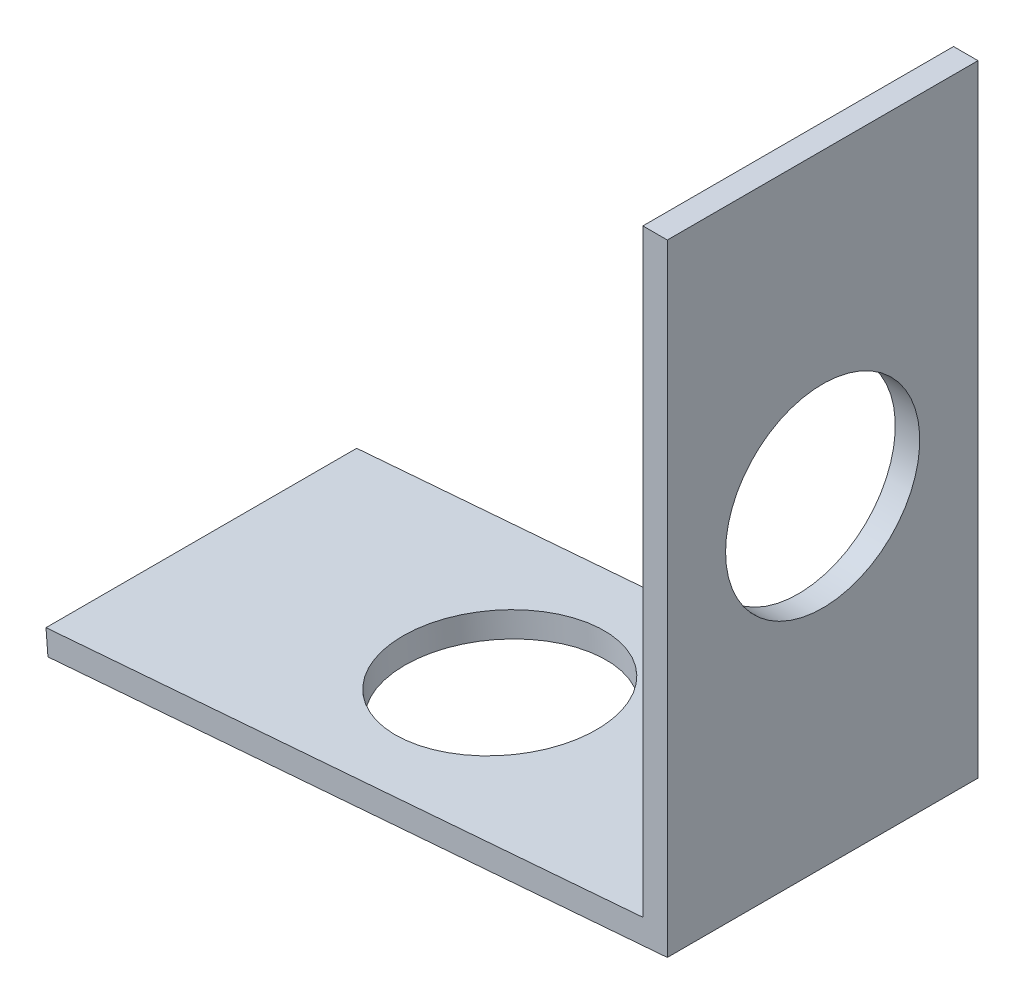
ISO-10303-21;
HEADER;
FILE_DESCRIPTION(('STEP AP214'),'2;1');
FILE_NAME('part.step','',(''),(''),'','','');
FILE_SCHEMA(('AUTOMOTIVE_DESIGN { 1 0 10303 214 1 1 1 1 }'));
ENDSEC;
DATA;
#1=APPLICATION_CONTEXT('core data for automotive mechanical design processes');
#2=APPLICATION_PROTOCOL_DEFINITION('international standard','automotive_design',2000,#1);
#3=PRODUCT_CONTEXT('',#1,'mechanical');
#4=PRODUCT('Part','Part','',(#3));
#5=PRODUCT_RELATED_PRODUCT_CATEGORY('part','',(#4));
#6=PRODUCT_DEFINITION_FORMATION('','',#4);
#7=PRODUCT_DEFINITION_CONTEXT('part definition',#1,'design');
#8=PRODUCT_DEFINITION('design','',#6,#7);
#9=PRODUCT_DEFINITION_SHAPE('','',#8);
#10=(LENGTH_UNIT() NAMED_UNIT(*) SI_UNIT(.MILLI.,.METRE.));
#11=(NAMED_UNIT(*) PLANE_ANGLE_UNIT() SI_UNIT($,.RADIAN.));
#12=(NAMED_UNIT(*) SI_UNIT($,.STERADIAN.) SOLID_ANGLE_UNIT());
#13=UNCERTAINTY_MEASURE_WITH_UNIT(LENGTH_MEASURE(1.E-05),#10,'distance_accuracy_value','');
#14=(GEOMETRIC_REPRESENTATION_CONTEXT(3) GLOBAL_UNCERTAINTY_ASSIGNED_CONTEXT((#13)) GLOBAL_UNIT_ASSIGNED_CONTEXT((#10,
#11,#12)) REPRESENTATION_CONTEXT('',''));
#15=CARTESIAN_POINT('',(0.,0.,0.));
#16=DIRECTION('',(0.,0.,1.));
#17=DIRECTION('',(1.,0.,0.));
#18=AXIS2_PLACEMENT_3D('',#15,#16,#17);
#19=CARTESIAN_POINT('',(0.,0.,6.35));
#20=DIRECTION('',(-0.079503021907664,0.996834624954184,0.));
#21=DIRECTION('',(-0.996834624954185,-0.079503021907664,0.));
#22=AXIS2_PLACEMENT_3D('',#19,#20,#21);
#23=PLANE('',#22);
#24=CARTESIAN_POINT('',(-13.1200482259643,-1.04639571642728,0.));
#25=DIRECTION('',(-0.079503021907664,0.996834624954184,0.));
#26=DIRECTION('',(-0.996834624954185,-0.079503021907664,0.));
#27=AXIS2_PLACEMENT_3D('',#24,#25,#26);
#28=CIRCLE('',#27,3.96874999999999);
#29=CARTESIAN_POINT('',(-17.0762356437512,-1.36192333462332,0.));
#30=VERTEX_POINT('',#29);
#31=EDGE_CURVE('E186',#30,#30,#28,.T.);
#32=ORIENTED_EDGE('',*,*,#31,.T.);
#33=EDGE_LOOP('',(#32));
#34=FACE_BOUND('',#33,.T.);
#35=DIRECTION('',(0.996834624954184,0.079503021907664,0.));
#36=VECTOR('',#35,1.);
#37=CARTESIAN_POINT('',(0.,0.,-6.35));
#38=LINE('',#37,#36);
#39=CARTESIAN_POINT('',(-25.3195994738363,-2.01937675645467,-6.35));
#40=VERTEX_POINT('',#39);
#41=CARTESIAN_POINT('',(0.,0.,-6.35));
#42=VERTEX_POINT('',#41);
#43=EDGE_CURVE('E132',#40,#42,#38,.T.);
#44=ORIENTED_EDGE('',*,*,#43,.T.);
#45=DIRECTION('',(0.,0.,-1.));
#46=VECTOR('',#45,1.);
#47=CARTESIAN_POINT('',(0.,0.,6.35));
#48=LINE('',#47,#46);
#49=CARTESIAN_POINT('',(0.,0.,6.35));
#50=VERTEX_POINT('',#49);
#51=EDGE_CURVE('E11',#50,#42,#48,.T.);
#52=ORIENTED_EDGE('',*,*,#51,.F.);
#53=DIRECTION('',(0.996834624954184,0.079503021907664,0.));
#54=VECTOR('',#53,1.);
#55=CARTESIAN_POINT('',(0.,0.,6.35));
#56=LINE('',#55,#54);
#57=CARTESIAN_POINT('',(-25.3195994738363,-2.01937675645467,6.35));
#58=VERTEX_POINT('',#57);
#59=EDGE_CURVE('E149',#58,#50,#56,.T.);
#60=ORIENTED_EDGE('',*,*,#59,.F.);
#61=DIRECTION('',(0.,0.,-1.));
#62=VECTOR('',#61,1.);
#63=CARTESIAN_POINT('',(-25.3195994738363,-2.01937675645467,6.35));
#64=LINE('',#63,#62);
#65=EDGE_CURVE('E128',#58,#40,#64,.T.);
#66=ORIENTED_EDGE('',*,*,#65,.T.);
#67=EDGE_LOOP('',(#44,#52,#60,#66));
#68=FACE_BOUND('',#67,.T.);
#69=ADVANCED_FACE('F43',(#34,#68),#23,.F.);
#70=CARTESIAN_POINT('',(0.,0.,6.35));
#71=DIRECTION('',(-1.,0.,0.));
#72=DIRECTION('',(0.,-1.,0.));
#73=AXIS2_PLACEMENT_3D('',#70,#71,#72);
#74=PLANE('',#73);
#75=CARTESIAN_POINT('',(0.,13.1617099742771,0.));
#76=DIRECTION('',(-1.,0.,0.));
#77=DIRECTION('',(0.,0.,1.));
#78=AXIS2_PLACEMENT_3D('',#75,#76,#77);
#79=CIRCLE('',#78,3.96875);
#80=CARTESIAN_POINT('',(0.,13.1617099742771,3.96875));
#81=VERTEX_POINT('',#80);
#82=EDGE_CURVE('E137',#81,#81,#79,.T.);
#83=ORIENTED_EDGE('',*,*,#82,.T.);
#84=EDGE_LOOP('',(#83));
#85=FACE_BOUND('',#84,.T.);
#86=DIRECTION('',(0.,1.,0.));
#87=VECTOR('',#86,1.);
#88=CARTESIAN_POINT('',(0.,0.,-6.35));
#89=LINE('',#88,#87);
#90=CARTESIAN_POINT('',(0.,25.4,-6.35));
#91=VERTEX_POINT('',#90);
#92=EDGE_CURVE('E136',#42,#91,#89,.T.);
#93=ORIENTED_EDGE('',*,*,#92,.T.);
#94=DIRECTION('',(0.,0.,-1.));
#95=VECTOR('',#94,1.);
#96=CARTESIAN_POINT('',(0.,25.4,6.35));
#97=LINE('',#96,#95);
#98=CARTESIAN_POINT('',(0.,25.4,6.35));
#99=VERTEX_POINT('',#98);
#100=EDGE_CURVE('E52',#99,#91,#97,.T.);
#101=ORIENTED_EDGE('',*,*,#100,.F.);
#102=DIRECTION('',(0.,1.,0.));
#103=VECTOR('',#102,1.);
#104=CARTESIAN_POINT('',(0.,0.,6.35));
#105=LINE('',#104,#103);
#106=EDGE_CURVE('E97',#50,#99,#105,.T.);
#107=ORIENTED_EDGE('',*,*,#106,.F.);
#108=ORIENTED_EDGE('',*,*,#51,.T.);
#109=EDGE_LOOP('',(#93,#101,#107,#108));
#110=FACE_BOUND('',#109,.T.);
#111=ADVANCED_FACE('F178',(#85,#110),#74,.F.);
#112=CARTESIAN_POINT('',(-1.,25.4,6.35));
#113=DIRECTION('',(0.,-1.,0.));
#114=DIRECTION('',(0.,0.,-1.));
#115=AXIS2_PLACEMENT_3D('',#112,#113,#114);
#116=PLANE('',#115);
#117=DIRECTION('',(-1.,0.,0.));
#118=VECTOR('',#117,1.);
#119=CARTESIAN_POINT('',(-1.,25.4,-6.35));
#120=LINE('',#119,#118);
#121=CARTESIAN_POINT('',(-1.,25.4,-6.35));
#122=VERTEX_POINT('',#121);
#123=EDGE_CURVE('E140',#91,#122,#120,.T.);
#124=ORIENTED_EDGE('',*,*,#123,.T.);
#125=DIRECTION('',(0.,0.,-1.));
#126=VECTOR('',#125,1.);
#127=CARTESIAN_POINT('',(-1.,25.4,6.35));
#128=LINE('',#127,#126);
#129=CARTESIAN_POINT('',(-1.,25.4,6.35));
#130=VERTEX_POINT('',#129);
#131=EDGE_CURVE('E121',#130,#122,#128,.T.);
#132=ORIENTED_EDGE('',*,*,#131,.F.);
#133=DIRECTION('',(-1.,0.,0.));
#134=VECTOR('',#133,1.);
#135=CARTESIAN_POINT('',(-1.,25.4,6.35));
#136=LINE('',#135,#134);
#137=EDGE_CURVE('E110',#99,#130,#136,.T.);
#138=ORIENTED_EDGE('',*,*,#137,.F.);
#139=ORIENTED_EDGE('',*,*,#100,.T.);
#140=EDGE_LOOP('',(#124,#132,#138,#139));
#141=FACE_BOUND('',#140,.T.);
#142=ADVANCED_FACE('F159',(#141),#116,.F.);
#143=CARTESIAN_POINT('',(-1.,0.923419948554298,6.35));
#144=DIRECTION('',(1.,0.,0.));
#145=DIRECTION('',(0.,1.,0.));
#146=AXIS2_PLACEMENT_3D('',#143,#144,#145);
#147=PLANE('',#146);
#148=CARTESIAN_POINT('',(-1.,13.1617099742771,0.));
#149=DIRECTION('',(-1.,0.,0.));
#150=DIRECTION('',(0.,0.,1.));
#151=AXIS2_PLACEMENT_3D('',#148,#149,#150);
#152=CIRCLE('',#151,3.96874999999999);
#153=CARTESIAN_POINT('',(-1.,13.1617099742771,3.96874999999999));
#154=VERTEX_POINT('',#153);
#155=EDGE_CURVE('E189',#154,#154,#152,.T.);
#156=ORIENTED_EDGE('',*,*,#155,.F.);
#157=EDGE_LOOP('',(#156));
#158=FACE_BOUND('',#157,.T.);
#159=DIRECTION('',(0.,-1.,0.));
#160=VECTOR('',#159,1.);
#161=CARTESIAN_POINT('',(-1.,0.923419948554298,-6.35));
#162=LINE('',#161,#160);
#163=CARTESIAN_POINT('',(-1.,0.923419948554298,-6.35));
#164=VERTEX_POINT('',#163);
#165=EDGE_CURVE('E119',#122,#164,#162,.T.);
#166=ORIENTED_EDGE('',*,*,#165,.T.);
#167=DIRECTION('',(0.,0.,-1.));
#168=VECTOR('',#167,1.);
#169=CARTESIAN_POINT('',(-1.,0.923419948554298,6.35));
#170=LINE('',#169,#168);
#171=CARTESIAN_POINT('',(-1.,0.923419948554298,6.35));
#172=VERTEX_POINT('',#171);
#173=EDGE_CURVE('E116',#172,#164,#170,.T.);
#174=ORIENTED_EDGE('',*,*,#173,.F.);
#175=DIRECTION('',(0.,-1.,0.));
#176=VECTOR('',#175,1.);
#177=CARTESIAN_POINT('',(-1.,0.923419948554298,6.35));
#178=LINE('',#177,#176);
#179=EDGE_CURVE('E104',#130,#172,#178,.T.);
#180=ORIENTED_EDGE('',*,*,#179,.F.);
#181=ORIENTED_EDGE('',*,*,#131,.T.);
#182=EDGE_LOOP('',(#166,#174,#180,#181));
#183=FACE_BOUND('',#182,.T.);
#184=ADVANCED_FACE('F117',(#158,#183),#147,.F.);
#185=CARTESIAN_POINT('',(-1.,0.923419948554298,6.35));
#186=DIRECTION('',(0.079503021907664,-0.996834624954184,0.));
#187=DIRECTION('',(0.996834624954184,0.079503021907664,0.));
#188=AXIS2_PLACEMENT_3D('',#185,#186,#187);
#189=PLANE('',#188);
#190=CARTESIAN_POINT('',(-13.199551247872,-0.0495610914730905,0.));
#191=DIRECTION('',(-0.079503021907664,0.996834624954185,0.));
#192=DIRECTION('',(-0.996834624954185,-0.079503021907664,0.));
#193=AXIS2_PLACEMENT_3D('',#190,#191,#192);
#194=CIRCLE('',#193,3.96874999999999);
#195=CARTESIAN_POINT('',(-17.1557386656589,-0.365088709669131,0.));
#196=VERTEX_POINT('',#195);
#197=EDGE_CURVE('E190',#196,#196,#194,.T.);
#198=ORIENTED_EDGE('',*,*,#197,.F.);
#199=EDGE_LOOP('',(#198));
#200=FACE_BOUND('',#199,.T.);
#201=DIRECTION('',(-0.996834624954185,-0.0795030219076641,0.));
#202=VECTOR('',#201,1.);
#203=CARTESIAN_POINT('',(-1.,0.923419948554298,-6.35));
#204=LINE('',#203,#202);
#205=CARTESIAN_POINT('',(-25.3991024957439,-1.02254213150048,-6.35));
#206=VERTEX_POINT('',#205);
#207=EDGE_CURVE('E83',#164,#206,#204,.T.);
#208=ORIENTED_EDGE('',*,*,#207,.T.);
#209=DIRECTION('',(0.,0.,-1.));
#210=VECTOR('',#209,1.);
#211=CARTESIAN_POINT('',(-25.3991024957439,-1.02254213150048,6.35));
#212=LINE('',#211,#210);
#213=CARTESIAN_POINT('',(-25.3991024957439,-1.02254213150048,6.35));
#214=VERTEX_POINT('',#213);
#215=EDGE_CURVE('E122',#214,#206,#212,.T.);
#216=ORIENTED_EDGE('',*,*,#215,.F.);
#217=DIRECTION('',(-0.996834624954185,-0.0795030219076641,0.));
#218=VECTOR('',#217,1.);
#219=CARTESIAN_POINT('',(-1.,0.923419948554298,6.35));
#220=LINE('',#219,#218);
#221=EDGE_CURVE('E108',#172,#214,#220,.T.);
#222=ORIENTED_EDGE('',*,*,#221,.F.);
#223=ORIENTED_EDGE('',*,*,#173,.T.);
#224=EDGE_LOOP('',(#208,#216,#222,#223));
#225=FACE_BOUND('',#224,.T.);
#226=ADVANCED_FACE('F124',(#200,#225),#189,.F.);
#227=CARTESIAN_POINT('',(-25.3991024957439,-1.02254213150048,6.35));
#228=DIRECTION('',(0.996834624954184,0.0795030219076648,0.));
#229=DIRECTION('',(-0.0795030219076648,0.996834624954185,0.));
#230=AXIS2_PLACEMENT_3D('',#227,#228,#229);
#231=PLANE('',#230);
#232=DIRECTION('',(0.0795030219076648,-0.996834624954184,0.));
#233=VECTOR('',#232,1.);
#234=CARTESIAN_POINT('',(-25.3991024957439,-1.02254213150048,-6.35));
#235=LINE('',#234,#233);
#236=EDGE_CURVE('E89',#206,#40,#235,.T.);
#237=ORIENTED_EDGE('',*,*,#236,.T.);
#238=ORIENTED_EDGE('',*,*,#65,.F.);
#239=DIRECTION('',(0.0795030219076648,-0.996834624954184,0.));
#240=VECTOR('',#239,1.);
#241=CARTESIAN_POINT('',(-25.3991024957439,-1.02254213150048,6.35));
#242=LINE('',#241,#240);
#243=EDGE_CURVE('E60',#214,#58,#242,.T.);
#244=ORIENTED_EDGE('',*,*,#243,.F.);
#245=ORIENTED_EDGE('',*,*,#215,.T.);
#246=EDGE_LOOP('',(#237,#238,#244,#245));
#247=FACE_BOUND('',#246,.T.);
#248=ADVANCED_FACE('F166',(#247),#231,.F.);
#249=CARTESIAN_POINT('',(0.,0.,6.35));
#250=DIRECTION('',(0.,0.,1.));
#251=DIRECTION('',(1.,0.,0.));
#252=AXIS2_PLACEMENT_3D('',#249,#250,#251);
#253=PLANE('',#252);
#254=ORIENTED_EDGE('',*,*,#59,.T.);
#255=ORIENTED_EDGE('',*,*,#106,.T.);
#256=ORIENTED_EDGE('',*,*,#137,.T.);
#257=ORIENTED_EDGE('',*,*,#179,.T.);
#258=ORIENTED_EDGE('',*,*,#221,.T.);
#259=ORIENTED_EDGE('',*,*,#243,.T.);
#260=EDGE_LOOP('',(#254,#255,#256,#257,#258,#259));
#261=FACE_BOUND('',#260,.T.);
#262=ADVANCED_FACE('F106',(#261),#253,.T.);
#263=CARTESIAN_POINT('',(0.,0.,-6.35));
#264=DIRECTION('',(0.,0.,1.));
#265=DIRECTION('',(1.,0.,0.));
#266=AXIS2_PLACEMENT_3D('',#263,#264,#265);
#267=PLANE('',#266);
#268=ORIENTED_EDGE('',*,*,#43,.F.);
#269=ORIENTED_EDGE('',*,*,#236,.F.);
#270=ORIENTED_EDGE('',*,*,#207,.F.);
#271=ORIENTED_EDGE('',*,*,#165,.F.);
#272=ORIENTED_EDGE('',*,*,#123,.F.);
#273=ORIENTED_EDGE('',*,*,#92,.F.);
#274=EDGE_LOOP('',(#268,#269,#270,#271,#272,#273));
#275=FACE_BOUND('',#274,.T.);
#276=ADVANCED_FACE('F162',(#275),#267,.F.);
#277=CARTESIAN_POINT('',(-1.,13.1617099742771,0.));
#278=DIRECTION('',(-1.,0.,0.));
#279=DIRECTION('',(0.,0.,1.));
#280=AXIS2_PLACEMENT_3D('',#277,#278,#279);
#281=CYLINDRICAL_SURFACE('',#280,3.96874999999999);
#282=ORIENTED_EDGE('',*,*,#82,.F.);
#283=EDGE_LOOP('',(#282));
#284=FACE_BOUND('',#283,.T.);
#285=ORIENTED_EDGE('',*,*,#155,.T.);
#286=EDGE_LOOP('',(#285));
#287=FACE_BOUND('',#286,.T.);
#288=ADVANCED_FACE('F208',(#284,#287),#281,.F.);
#289=CARTESIAN_POINT('',(-13.199551247872,-0.0495610914730915,0.));
#290=DIRECTION('',(-0.079503021907664,0.996834624954185,0.));
#291=DIRECTION('',(-0.996834624954185,-0.079503021907664,0.));
#292=AXIS2_PLACEMENT_3D('',#289,#290,#291);
#293=CYLINDRICAL_SURFACE('',#292,3.96874999999999);
#294=ORIENTED_EDGE('',*,*,#197,.T.);
#295=EDGE_LOOP('',(#294));
#296=FACE_BOUND('',#295,.T.);
#297=ORIENTED_EDGE('',*,*,#31,.F.);
#298=EDGE_LOOP('',(#297));
#299=FACE_BOUND('',#298,.T.);
#300=ADVANCED_FACE('F211',(#296,#299),#293,.F.);
#301=CLOSED_SHELL('',(#69,#111,#142,#184,#226,#248,#262,#276,#288,#300));
#302=MANIFOLD_SOLID_BREP('B2',#301);
#303=ADVANCED_BREP_SHAPE_REPRESENTATION('',(#18,#302),#14);
#304=SHAPE_DEFINITION_REPRESENTATION(#9,#303);
ENDSEC;
END-ISO-10303-21;
